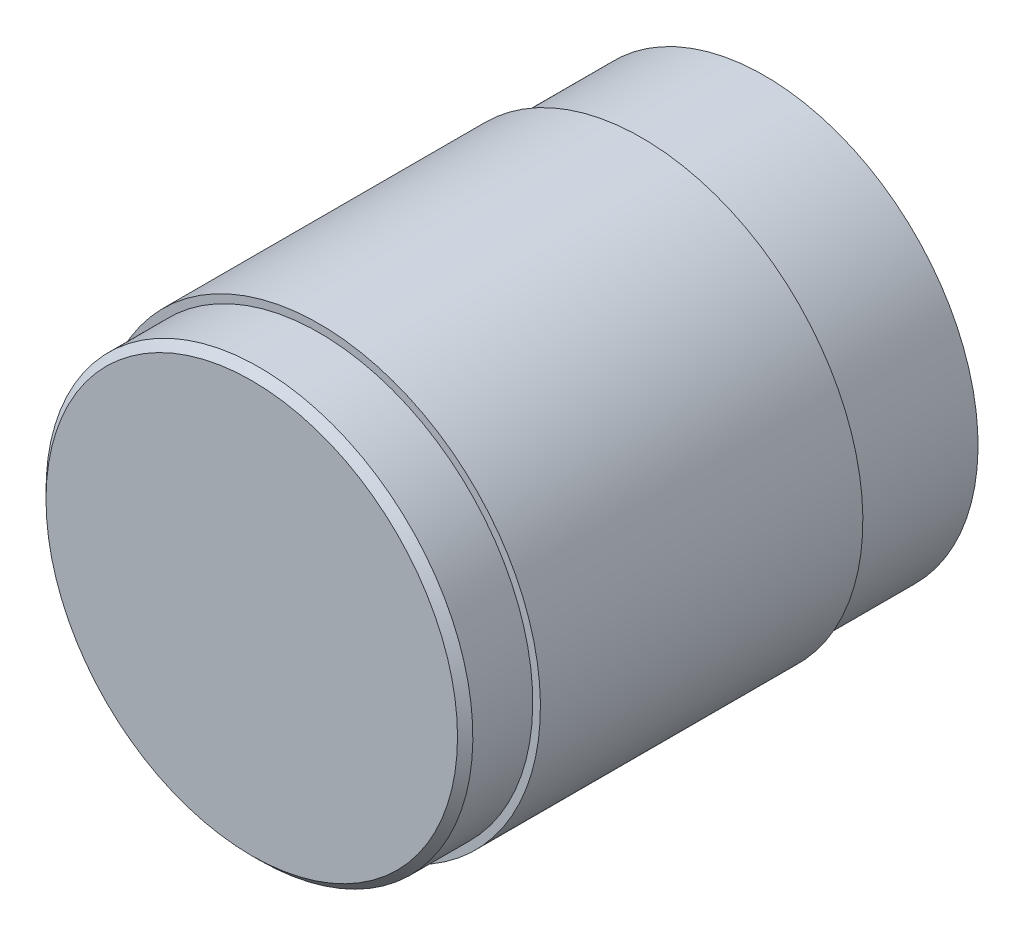
ISO-10303-21;
HEADER;
FILE_DESCRIPTION(('STEP AP214'),'2;1');
FILE_NAME('part.step','',(''),(''),'','','');
FILE_SCHEMA(('AUTOMOTIVE_DESIGN { 1 0 10303 214 1 1 1 1 }'));
ENDSEC;
DATA;
#1=APPLICATION_CONTEXT('core data for automotive mechanical design processes');
#2=APPLICATION_PROTOCOL_DEFINITION('international standard','automotive_design',2000,#1);
#3=PRODUCT_CONTEXT('',#1,'mechanical');
#4=PRODUCT('Part','Part','',(#3));
#5=PRODUCT_RELATED_PRODUCT_CATEGORY('part','',(#4));
#6=PRODUCT_DEFINITION_FORMATION('','',#4);
#7=PRODUCT_DEFINITION_CONTEXT('part definition',#1,'design');
#8=PRODUCT_DEFINITION('design','',#6,#7);
#9=PRODUCT_DEFINITION_SHAPE('','',#8);
#10=(LENGTH_UNIT() NAMED_UNIT(*) SI_UNIT(.MILLI.,.METRE.));
#11=(NAMED_UNIT(*) PLANE_ANGLE_UNIT() SI_UNIT($,.RADIAN.));
#12=(NAMED_UNIT(*) SI_UNIT($,.STERADIAN.) SOLID_ANGLE_UNIT());
#13=UNCERTAINTY_MEASURE_WITH_UNIT(LENGTH_MEASURE(1.E-05),#10,'distance_accuracy_value','');
#14=(GEOMETRIC_REPRESENTATION_CONTEXT(3) GLOBAL_UNCERTAINTY_ASSIGNED_CONTEXT((#13)) GLOBAL_UNIT_ASSIGNED_CONTEXT((#10,
#11,#12)) REPRESENTATION_CONTEXT('',''));
#15=CARTESIAN_POINT('',(0.,0.,0.));
#16=DIRECTION('',(0.,0.,1.));
#17=DIRECTION('',(1.,0.,0.));
#18=AXIS2_PLACEMENT_3D('',#15,#16,#17);
#19=CARTESIAN_POINT('',(6.56005817375007,8.00183010751234,8.40000000000001));
#20=DIRECTION('',(0.,-4.37113880000001E-08,0.999999999999999));
#21=DIRECTION('',(0.,-0.999999999999999,-4.37113880000001E-08));
#22=AXIS2_PLACEMENT_3D('',#19,#20,#21);
#23=CYLINDRICAL_SURFACE('',#22,6.95);
#24=CARTESIAN_POINT('',(6.56005817375019,8.00182938846001,24.85));
#25=DIRECTION('',(0.,-4.3711381736422E-08,0.999999999999999));
#26=DIRECTION('',(0.,-0.999999999999999,-4.3711381736422E-08));
#27=AXIS2_PLACEMENT_3D('',#24,#25,#26);
#28=CIRCLE('',#27,6.95);
#29=CARTESIAN_POINT('',(6.56005817375019,1.05182938846001,24.8499996962059));
#30=VERTEX_POINT('',#29);
#31=EDGE_CURVE('E10',#30,#30,#28,.F.);
#32=ORIENTED_EDGE('',*,*,#31,.T.);
#33=EDGE_LOOP('',(#32));
#34=FACE_BOUND('',#33,.T.);
#35=CARTESIAN_POINT('',(6.56005817375018,8.00182947369722,22.9));
#36=DIRECTION('',(0.,-4.37113878946152E-08,0.999999999999999));
#37=DIRECTION('',(0.,-0.999999999999999,-4.37113878946152E-08));
#38=AXIS2_PLACEMENT_3D('',#35,#36,#37);
#39=CIRCLE('',#38,6.95);
#40=CARTESIAN_POINT('',(6.56005817375018,1.05182947369722,22.8999996962058));
#41=VERTEX_POINT('',#40);
#42=EDGE_CURVE('E53',#41,#41,#39,.F.);
#43=ORIENTED_EDGE('',*,*,#42,.F.);
#44=EDGE_LOOP('',(#43));
#45=FACE_BOUND('',#44,.T.);
#46=ADVANCED_FACE('F41',(#34,#45),#23,.T.);
#47=CARTESIAN_POINT('',(1.90880436047433E-13,-1.09715582125579E-06,25.0999996502289));
#48=DIRECTION('',(0.,-4.37113878946152E-08,0.999999999999999));
#49=DIRECTION('',(0.,-0.999999999999999,-4.37113878946152E-08));
#50=AXIS2_PLACEMENT_3D('',#47,#48,#49);
#51=PLANE('',#50);
#52=CARTESIAN_POINT('',(6.56005817375019,8.00182937753216,25.1));
#53=DIRECTION('',(0.,-4.37113878946152E-08,0.999999999999999));
#54=DIRECTION('',(0.,-0.999999999999999,-4.37113878946152E-08));
#55=AXIS2_PLACEMENT_3D('',#52,#53,#54);
#56=CIRCLE('',#55,6.70000000000005);
#57=CARTESIAN_POINT('',(6.56005817375019,1.30182937753212,25.0999997071337));
#58=VERTEX_POINT('',#57);
#59=EDGE_CURVE('E49',#58,#58,#56,.T.);
#60=ORIENTED_EDGE('',*,*,#59,.T.);
#61=EDGE_LOOP('',(#60));
#62=FACE_BOUND('',#61,.T.);
#63=ADVANCED_FACE('F77',(#62),#51,.T.);
#64=CARTESIAN_POINT('',(6.56005817375018,8.00182947369722,22.9));
#65=DIRECTION('',(0.,4.37113880000001E-08,-0.999999999999999));
#66=DIRECTION('',(0.,0.999999999999999,4.37113880000001E-08));
#67=AXIS2_PLACEMENT_3D('',#64,#65,#66);
#68=CYLINDRICAL_SURFACE('',#67,7.2);
#69=CARTESIAN_POINT('',(6.56005817375018,8.00182947369722,22.9));
#70=DIRECTION('',(0.,-4.37113878946152E-08,0.999999999999999));
#71=DIRECTION('',(0.,-0.999999999999999,-4.37113878946152E-08));
#72=AXIS2_PLACEMENT_3D('',#69,#70,#71);
#73=CIRCLE('',#72,7.2);
#74=CARTESIAN_POINT('',(6.56005817375018,0.801829473697222,22.899999685278));
#75=VERTEX_POINT('',#74);
#76=EDGE_CURVE('E62',#75,#75,#73,.T.);
#77=ORIENTED_EDGE('',*,*,#76,.F.);
#78=EDGE_LOOP('',(#77));
#79=FACE_BOUND('',#78,.T.);
#80=CARTESIAN_POINT('',(6.5600581737501,8.00182993266679,12.4));
#81=DIRECTION('',(0.,-4.37113878946152E-08,0.999999999999999));
#82=DIRECTION('',(0.,-0.999999999999999,-4.37113878946152E-08));
#83=AXIS2_PLACEMENT_3D('',#80,#81,#82);
#84=CIRCLE('',#83,7.2);
#85=CARTESIAN_POINT('',(6.5600581737501,0.801829932666797,12.399999685278));
#86=VERTEX_POINT('',#85);
#87=EDGE_CURVE('E63',#86,#86,#84,.T.);
#88=ORIENTED_EDGE('',*,*,#87,.T.);
#89=EDGE_LOOP('',(#88));
#90=FACE_BOUND('',#89,.T.);
#91=ADVANCED_FACE('F74',(#79,#90),#68,.T.);
#92=CARTESIAN_POINT('',(1.74066404071467E-13,-1.00099076765579E-06,22.8999996502289));
#93=DIRECTION('',(0.,-4.37113878946152E-08,0.999999999999999));
#94=DIRECTION('',(0.,-0.999999999999999,-4.37113878946152E-08));
#95=AXIS2_PLACEMENT_3D('',#92,#93,#94);
#96=PLANE('',#95);
#97=ORIENTED_EDGE('',*,*,#42,.T.);
#98=EDGE_LOOP('',(#97));
#99=FACE_BOUND('',#98,.T.);
#100=ORIENTED_EDGE('',*,*,#76,.T.);
#101=EDGE_LOOP('',(#100));
#102=FACE_BOUND('',#101,.T.);
#103=ADVANCED_FACE('F72',(#99,#102),#96,.T.);
#104=CARTESIAN_POINT('',(0.,-5.42021193655788E-07,12.3999996502289));
#105=DIRECTION('',(0.,-4.37113878946152E-08,0.999999999999999));
#106=DIRECTION('',(0.,-0.999999999999999,-4.37113878946152E-08));
#107=AXIS2_PLACEMENT_3D('',#104,#105,#106);
#108=PLANE('',#107);
#109=CARTESIAN_POINT('',(6.5600581737501,8.00182993266679,12.4));
#110=DIRECTION('',(0.,-4.37113878946152E-08,0.999999999999999));
#111=DIRECTION('',(0.,-0.999999999999999,-4.37113878946152E-08));
#112=AXIS2_PLACEMENT_3D('',#109,#110,#111);
#113=CIRCLE('',#112,6.95);
#114=CARTESIAN_POINT('',(6.5600581737501,1.0518299326668,12.3999996962059));
#115=VERTEX_POINT('',#114);
#116=EDGE_CURVE('E66',#115,#115,#113,.T.);
#117=ORIENTED_EDGE('',*,*,#116,.T.);
#118=EDGE_LOOP('',(#117));
#119=FACE_BOUND('',#118,.T.);
#120=ORIENTED_EDGE('',*,*,#87,.F.);
#121=EDGE_LOOP('',(#120));
#122=FACE_BOUND('',#121,.T.);
#123=ADVANCED_FACE('F81',(#119,#122),#108,.F.);
#124=CARTESIAN_POINT('',(0.,-3.67175641655787E-07,8.39999965022895));
#125=DIRECTION('',(0.,-4.37113878946152E-08,0.999999999999999));
#126=DIRECTION('',(0.,-0.999999999999999,-4.37113878946152E-08));
#127=AXIS2_PLACEMENT_3D('',#124,#125,#126);
#128=PLANE('',#127);
#129=CARTESIAN_POINT('',(6.56005817375007,8.00183010751234,8.40000000000001));
#130=DIRECTION('',(0.,-4.37113878946152E-08,0.999999999999999));
#131=DIRECTION('',(0.,-0.999999999999999,-4.37113878946152E-08));
#132=AXIS2_PLACEMENT_3D('',#129,#130,#131);
#133=CIRCLE('',#132,6.95);
#134=CARTESIAN_POINT('',(6.56005817375007,1.05183010751235,8.39999969620587));
#135=VERTEX_POINT('',#134);
#136=EDGE_CURVE('E57',#135,#135,#133,.T.);
#137=ORIENTED_EDGE('',*,*,#136,.F.);
#138=EDGE_LOOP('',(#137));
#139=FACE_BOUND('',#138,.T.);
#140=ADVANCED_FACE('F83',(#139),#128,.F.);
#141=ORIENTED_EDGE('',*,*,#136,.T.);
#142=EDGE_LOOP('',(#141));
#143=FACE_BOUND('',#142,.T.);
#144=ORIENTED_EDGE('',*,*,#116,.F.);
#145=EDGE_LOOP('',(#144));
#146=FACE_BOUND('',#145,.T.);
#147=ADVANCED_FACE('F91',(#143,#146),#23,.T.);
#148=CARTESIAN_POINT('',(6.56005817375019,8.00182937753216,25.1));
#149=DIRECTION('',(0.,4.3711381736422E-08,-0.999999999999999));
#150=DIRECTION('',(0.,0.999999999999999,4.3711381736422E-08));
#151=AXIS2_PLACEMENT_3D('',#148,#149,#150);
#152=CONICAL_SURFACE('',#151,6.70000000000001,0.785398163397432);
#153=ORIENTED_EDGE('',*,*,#31,.F.);
#154=EDGE_LOOP('',(#153));
#155=FACE_BOUND('',#154,.T.);
#156=ORIENTED_EDGE('',*,*,#59,.F.);
#157=EDGE_LOOP('',(#156));
#158=FACE_BOUND('',#157,.T.);
#159=ADVANCED_FACE('F44',(#155,#158),#152,.T.);
#160=CLOSED_SHELL('',(#46,#63,#91,#103,#123,#140,#147,#159));
#161=MANIFOLD_SOLID_BREP('B2',#160);
#162=ADVANCED_BREP_SHAPE_REPRESENTATION('',(#18,#161),#14);
#163=SHAPE_DEFINITION_REPRESENTATION(#9,#162);
ENDSEC;
END-ISO-10303-21;
